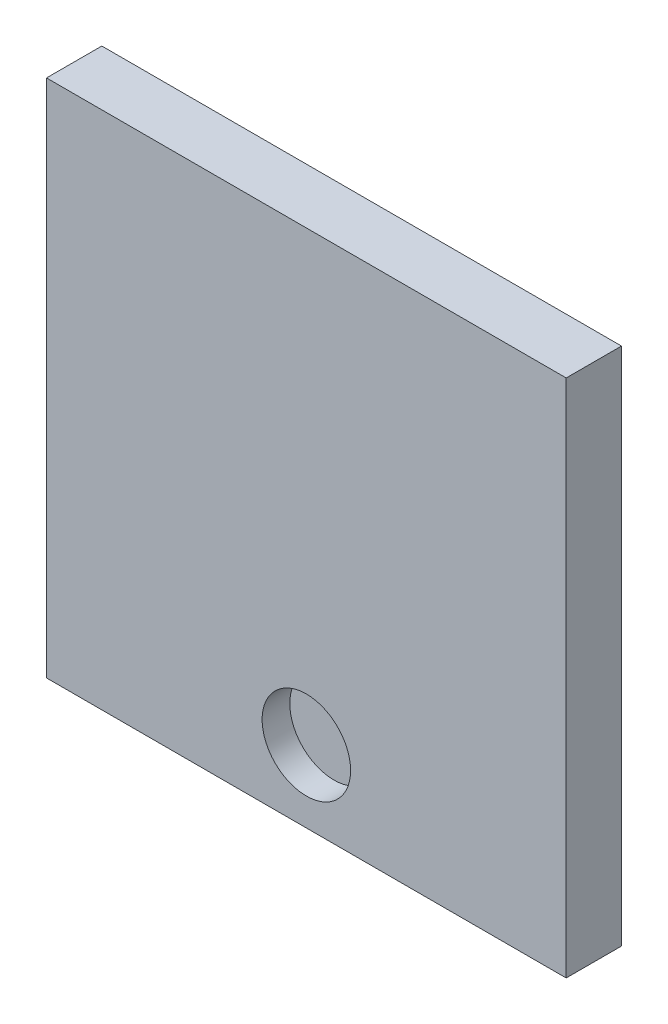
ISO-10303-21;
HEADER;
FILE_DESCRIPTION(('STEP AP214'),'2;1');
FILE_NAME('part.step','',(''),(''),'','','');
FILE_SCHEMA(('AUTOMOTIVE_DESIGN { 1 0 10303 214 1 1 1 1 }'));
ENDSEC;
DATA;
#1=APPLICATION_CONTEXT('core data for automotive mechanical design processes');
#2=APPLICATION_PROTOCOL_DEFINITION('international standard','automotive_design',2000,#1);
#3=PRODUCT_CONTEXT('',#1,'mechanical');
#4=PRODUCT('Part','Part','',(#3));
#5=PRODUCT_RELATED_PRODUCT_CATEGORY('part','',(#4));
#6=PRODUCT_DEFINITION_FORMATION('','',#4);
#7=PRODUCT_DEFINITION_CONTEXT('part definition',#1,'design');
#8=PRODUCT_DEFINITION('design','',#6,#7);
#9=PRODUCT_DEFINITION_SHAPE('','',#8);
#10=(LENGTH_UNIT() NAMED_UNIT(*) SI_UNIT(.MILLI.,.METRE.));
#11=(NAMED_UNIT(*) PLANE_ANGLE_UNIT() SI_UNIT($,.RADIAN.));
#12=(NAMED_UNIT(*) SI_UNIT($,.STERADIAN.) SOLID_ANGLE_UNIT());
#13=UNCERTAINTY_MEASURE_WITH_UNIT(LENGTH_MEASURE(1.E-05),#10,'distance_accuracy_value','');
#14=(GEOMETRIC_REPRESENTATION_CONTEXT(3) GLOBAL_UNCERTAINTY_ASSIGNED_CONTEXT((#13)) GLOBAL_UNIT_ASSIGNED_CONTEXT((#10,
#11,#12)) REPRESENTATION_CONTEXT('',''));
#15=CARTESIAN_POINT('',(0.,0.,0.));
#16=DIRECTION('',(0.,0.,1.));
#17=DIRECTION('',(1.,0.,0.));
#18=AXIS2_PLACEMENT_3D('',#15,#16,#17);
#19=CARTESIAN_POINT('',(-47.,-47.,10.));
#20=DIRECTION('',(1.,0.,0.));
#21=DIRECTION('',(0.,0.,-1.));
#22=AXIS2_PLACEMENT_3D('',#19,#20,#21);
#23=PLANE('',#22);
#24=DIRECTION('',(0.,-1.,0.));
#25=VECTOR('',#24,1.);
#26=CARTESIAN_POINT('',(-47.,-47.,0.));
#27=LINE('',#26,#25);
#28=CARTESIAN_POINT('',(-47.,47.,0.));
#29=VERTEX_POINT('',#28);
#30=CARTESIAN_POINT('',(-47.,-47.,0.));
#31=VERTEX_POINT('',#30);
#32=EDGE_CURVE('E98',#29,#31,#27,.T.);
#33=ORIENTED_EDGE('',*,*,#32,.T.);
#34=DIRECTION('',(0.,0.,-1.));
#35=VECTOR('',#34,1.);
#36=CARTESIAN_POINT('',(-47.,-47.,10.));
#37=LINE('',#36,#35);
#38=CARTESIAN_POINT('',(-47.,-47.,10.));
#39=VERTEX_POINT('',#38);
#40=EDGE_CURVE('E11',#39,#31,#37,.T.);
#41=ORIENTED_EDGE('',*,*,#40,.F.);
#42=DIRECTION('',(0.,-1.,0.));
#43=VECTOR('',#42,1.);
#44=CARTESIAN_POINT('',(-47.,-47.,10.));
#45=LINE('',#44,#43);
#46=CARTESIAN_POINT('',(-47.,47.,10.));
#47=VERTEX_POINT('',#46);
#48=EDGE_CURVE('E86',#47,#39,#45,.T.);
#49=ORIENTED_EDGE('',*,*,#48,.F.);
#50=DIRECTION('',(0.,0.,-1.));
#51=VECTOR('',#50,1.);
#52=CARTESIAN_POINT('',(-47.,47.,10.));
#53=LINE('',#52,#51);
#54=EDGE_CURVE('E94',#47,#29,#53,.T.);
#55=ORIENTED_EDGE('',*,*,#54,.T.);
#56=EDGE_LOOP('',(#33,#41,#49,#55));
#57=FACE_BOUND('',#56,.T.);
#58=ADVANCED_FACE('F35',(#57),#23,.F.);
#59=CARTESIAN_POINT('',(47.,-47.,10.));
#60=DIRECTION('',(0.,1.,0.));
#61=DIRECTION('',(-1.,0.,0.));
#62=AXIS2_PLACEMENT_3D('',#59,#60,#61);
#63=PLANE('',#62);
#64=DIRECTION('',(1.,0.,0.));
#65=VECTOR('',#64,1.);
#66=CARTESIAN_POINT('',(47.,-47.,0.));
#67=LINE('',#66,#65);
#68=CARTESIAN_POINT('',(47.,-47.,0.));
#69=VERTEX_POINT('',#68);
#70=EDGE_CURVE('E90',#31,#69,#67,.T.);
#71=ORIENTED_EDGE('',*,*,#70,.T.);
#72=DIRECTION('',(0.,0.,-1.));
#73=VECTOR('',#72,1.);
#74=CARTESIAN_POINT('',(47.,-47.,10.));
#75=LINE('',#74,#73);
#76=CARTESIAN_POINT('',(47.,-47.,10.));
#77=VERTEX_POINT('',#76);
#78=EDGE_CURVE('E43',#77,#69,#75,.T.);
#79=ORIENTED_EDGE('',*,*,#78,.F.);
#80=DIRECTION('',(1.,0.,0.));
#81=VECTOR('',#80,1.);
#82=CARTESIAN_POINT('',(47.,-47.,10.));
#83=LINE('',#82,#81);
#84=EDGE_CURVE('E81',#39,#77,#83,.T.);
#85=ORIENTED_EDGE('',*,*,#84,.F.);
#86=ORIENTED_EDGE('',*,*,#40,.T.);
#87=EDGE_LOOP('',(#71,#79,#85,#86));
#88=FACE_BOUND('',#87,.T.);
#89=ADVANCED_FACE('F89',(#88),#63,.F.);
#90=CARTESIAN_POINT('',(47.,-47.,10.));
#91=DIRECTION('',(-1.,0.,0.));
#92=DIRECTION('',(0.,0.,1.));
#93=AXIS2_PLACEMENT_3D('',#90,#91,#92);
#94=PLANE('',#93);
#95=DIRECTION('',(0.,1.,0.));
#96=VECTOR('',#95,1.);
#97=CARTESIAN_POINT('',(47.,-47.,0.));
#98=LINE('',#97,#96);
#99=CARTESIAN_POINT('',(47.,47.,0.));
#100=VERTEX_POINT('',#99);
#101=EDGE_CURVE('E68',#69,#100,#98,.T.);
#102=ORIENTED_EDGE('',*,*,#101,.T.);
#103=DIRECTION('',(0.,0.,-1.));
#104=VECTOR('',#103,1.);
#105=CARTESIAN_POINT('',(47.,47.,10.));
#106=LINE('',#105,#104);
#107=CARTESIAN_POINT('',(47.,47.,10.));
#108=VERTEX_POINT('',#107);
#109=EDGE_CURVE('E91',#108,#100,#106,.T.);
#110=ORIENTED_EDGE('',*,*,#109,.F.);
#111=DIRECTION('',(0.,1.,0.));
#112=VECTOR('',#111,1.);
#113=CARTESIAN_POINT('',(47.,-47.,10.));
#114=LINE('',#113,#112);
#115=EDGE_CURVE('E84',#77,#108,#114,.T.);
#116=ORIENTED_EDGE('',*,*,#115,.F.);
#117=ORIENTED_EDGE('',*,*,#78,.T.);
#118=EDGE_LOOP('',(#102,#110,#116,#117));
#119=FACE_BOUND('',#118,.T.);
#120=ADVANCED_FACE('F92',(#119),#94,.F.);
#121=CARTESIAN_POINT('',(47.,47.,10.));
#122=DIRECTION('',(0.,-1.,0.));
#123=DIRECTION('',(1.,0.,0.));
#124=AXIS2_PLACEMENT_3D('',#121,#122,#123);
#125=PLANE('',#124);
#126=DIRECTION('',(-1.,0.,0.));
#127=VECTOR('',#126,1.);
#128=CARTESIAN_POINT('',(47.,47.,0.));
#129=LINE('',#128,#127);
#130=EDGE_CURVE('E74',#100,#29,#129,.T.);
#131=ORIENTED_EDGE('',*,*,#130,.T.);
#132=ORIENTED_EDGE('',*,*,#54,.F.);
#133=DIRECTION('',(-1.,0.,0.));
#134=VECTOR('',#133,1.);
#135=CARTESIAN_POINT('',(47.,47.,10.));
#136=LINE('',#135,#134);
#137=EDGE_CURVE('E51',#108,#47,#136,.T.);
#138=ORIENTED_EDGE('',*,*,#137,.F.);
#139=ORIENTED_EDGE('',*,*,#109,.T.);
#140=EDGE_LOOP('',(#131,#132,#138,#139));
#141=FACE_BOUND('',#140,.T.);
#142=ADVANCED_FACE('F106',(#141),#125,.F.);
#143=CARTESIAN_POINT('',(0.,0.,10.));
#144=DIRECTION('',(0.,0.,1.));
#145=DIRECTION('',(1.,0.,0.));
#146=AXIS2_PLACEMENT_3D('',#143,#144,#145);
#147=PLANE('',#146);
#148=CARTESIAN_POINT('',(0.,-34.,10.));
#149=DIRECTION('',(0.,0.,1.));
#150=DIRECTION('',(1.,0.,0.));
#151=AXIS2_PLACEMENT_3D('',#148,#149,#150);
#152=CIRCLE('',#151,8.);
#153=CARTESIAN_POINT('',(7.99999999999998,-34.,10.));
#154=VERTEX_POINT('',#153);
#155=EDGE_CURVE('E112',#154,#154,#152,.T.);
#156=ORIENTED_EDGE('',*,*,#155,.F.);
#157=EDGE_LOOP('',(#156));
#158=FACE_BOUND('',#157,.T.);
#159=ORIENTED_EDGE('',*,*,#48,.T.);
#160=ORIENTED_EDGE('',*,*,#84,.T.);
#161=ORIENTED_EDGE('',*,*,#115,.T.);
#162=ORIENTED_EDGE('',*,*,#137,.T.);
#163=EDGE_LOOP('',(#159,#160,#161,#162));
#164=FACE_BOUND('',#163,.T.);
#165=ADVANCED_FACE('F82',(#158,#164),#147,.T.);
#166=CARTESIAN_POINT('',(0.,0.,0.));
#167=DIRECTION('',(0.,0.,1.));
#168=DIRECTION('',(1.,0.,0.));
#169=AXIS2_PLACEMENT_3D('',#166,#167,#168);
#170=PLANE('',#169);
#171=ORIENTED_EDGE('',*,*,#32,.F.);
#172=ORIENTED_EDGE('',*,*,#130,.F.);
#173=ORIENTED_EDGE('',*,*,#101,.F.);
#174=ORIENTED_EDGE('',*,*,#70,.F.);
#175=EDGE_LOOP('',(#171,#172,#173,#174));
#176=FACE_BOUND('',#175,.T.);
#177=ADVANCED_FACE('F109',(#176),#170,.F.);
#178=CARTESIAN_POINT('',(0.,-34.,5.));
#179=DIRECTION('',(0.,0.,1.));
#180=DIRECTION('',(1.,0.,0.));
#181=AXIS2_PLACEMENT_3D('',#178,#179,#180);
#182=CYLINDRICAL_SURFACE('',#181,8.);
#183=CARTESIAN_POINT('',(0.,-34.,5.));
#184=DIRECTION('',(0.,0.,1.));
#185=DIRECTION('',(1.,0.,0.));
#186=AXIS2_PLACEMENT_3D('',#183,#184,#185);
#187=CIRCLE('',#186,8.);
#188=CARTESIAN_POINT('',(7.99999999999998,-34.,5.));
#189=VERTEX_POINT('',#188);
#190=EDGE_CURVE('E101',#189,#189,#187,.T.);
#191=ORIENTED_EDGE('',*,*,#190,.F.);
#192=EDGE_LOOP('',(#191));
#193=FACE_BOUND('',#192,.T.);
#194=ORIENTED_EDGE('',*,*,#155,.T.);
#195=EDGE_LOOP('',(#194));
#196=FACE_BOUND('',#195,.T.);
#197=ADVANCED_FACE('F120',(#193,#196),#182,.F.);
#198=CARTESIAN_POINT('',(0.,-34.,5.));
#199=DIRECTION('',(0.,0.,1.));
#200=DIRECTION('',(1.,0.,0.));
#201=AXIS2_PLACEMENT_3D('',#198,#199,#200);
#202=PLANE('',#201);
#203=ORIENTED_EDGE('',*,*,#190,.T.);
#204=EDGE_LOOP('',(#203));
#205=FACE_BOUND('',#204,.T.);
#206=ADVANCED_FACE('F118',(#205),#202,.T.);
#207=CLOSED_SHELL('',(#58,#89,#120,#142,#165,#177,#197,#206));
#208=MANIFOLD_SOLID_BREP('B2',#207);
#209=ADVANCED_BREP_SHAPE_REPRESENTATION('',(#18,#208),#14);
#210=SHAPE_DEFINITION_REPRESENTATION(#9,#209);
ENDSEC;
END-ISO-10303-21;
